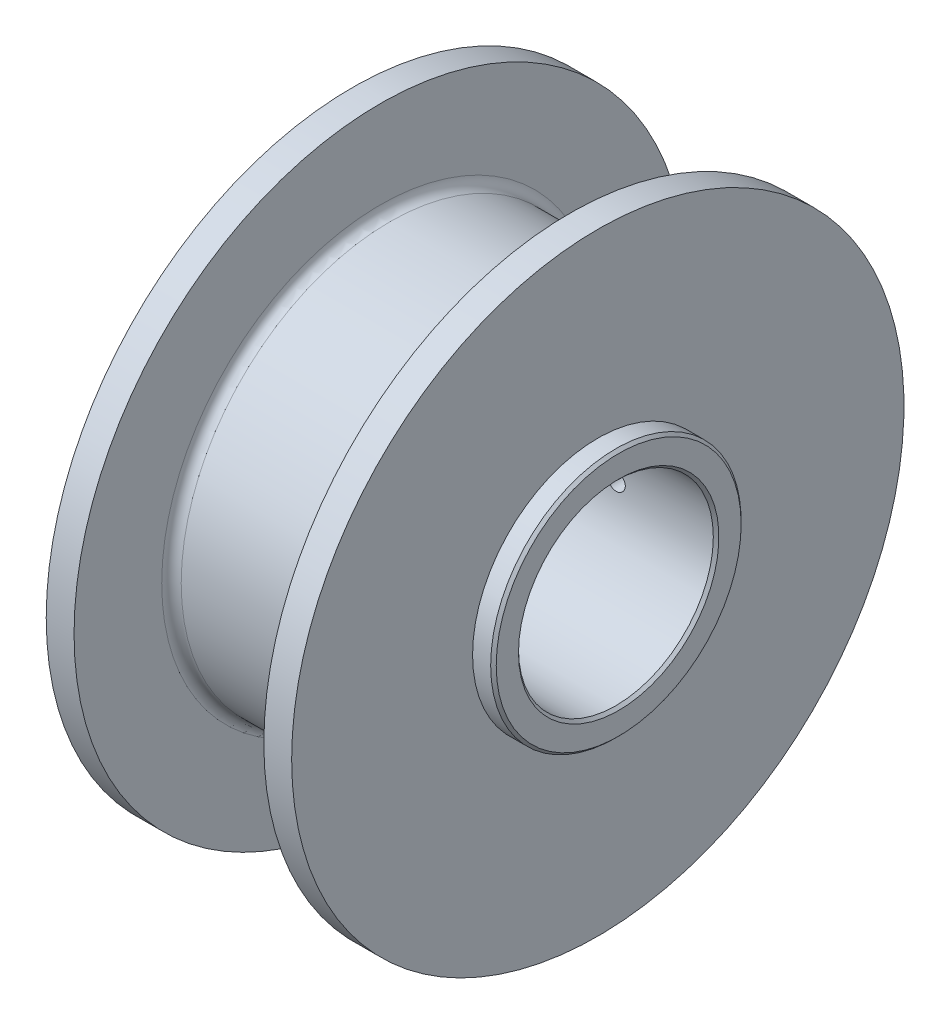
ISO-10303-21;
HEADER;
FILE_DESCRIPTION(('STEP AP214'),'2;1');
FILE_NAME('part.step','',(''),(''),'','','');
FILE_SCHEMA(('AUTOMOTIVE_DESIGN { 1 0 10303 214 1 1 1 1 }'));
ENDSEC;
DATA;
#1=APPLICATION_CONTEXT('core data for automotive mechanical design processes');
#2=APPLICATION_PROTOCOL_DEFINITION('international standard','automotive_design',2000,#1);
#3=PRODUCT_CONTEXT('',#1,'mechanical');
#4=PRODUCT('Part','Part','',(#3));
#5=PRODUCT_RELATED_PRODUCT_CATEGORY('part','',(#4));
#6=PRODUCT_DEFINITION_FORMATION('','',#4);
#7=PRODUCT_DEFINITION_CONTEXT('part definition',#1,'design');
#8=PRODUCT_DEFINITION('design','',#6,#7);
#9=PRODUCT_DEFINITION_SHAPE('','',#8);
#10=(LENGTH_UNIT() NAMED_UNIT(*) SI_UNIT(.MILLI.,.METRE.));
#11=(NAMED_UNIT(*) PLANE_ANGLE_UNIT() SI_UNIT($,.RADIAN.));
#12=(NAMED_UNIT(*) SI_UNIT($,.STERADIAN.) SOLID_ANGLE_UNIT());
#13=UNCERTAINTY_MEASURE_WITH_UNIT(LENGTH_MEASURE(1.E-05),#10,'distance_accuracy_value','');
#14=(GEOMETRIC_REPRESENTATION_CONTEXT(3) GLOBAL_UNCERTAINTY_ASSIGNED_CONTEXT((#13)) GLOBAL_UNIT_ASSIGNED_CONTEXT((#10,
#11,#12)) REPRESENTATION_CONTEXT('',''));
#15=CARTESIAN_POINT('',(0.,0.,0.));
#16=DIRECTION('',(0.,0.,1.));
#17=DIRECTION('',(1.,0.,0.));
#18=AXIS2_PLACEMENT_3D('',#15,#16,#17);
#19=CARTESIAN_POINT('',(0.,0.,0.));
#20=DIRECTION('',(-1.,0.,0.));
#21=DIRECTION('',(0.,0.,1.));
#22=AXIS2_PLACEMENT_3D('',#19,#20,#21);
#23=CYLINDRICAL_SURFACE('',#22,38.1);
#24=CARTESIAN_POINT('',(10.668,0.,0.));
#25=DIRECTION('',(-1.,0.,0.));
#26=DIRECTION('',(0.,0.,1.));
#27=AXIS2_PLACEMENT_3D('',#24,#25,#26);
#28=CIRCLE('',#27,38.1);
#29=CARTESIAN_POINT('',(10.668,0.,38.1));
#30=VERTEX_POINT('',#29);
#31=EDGE_CURVE('E193',#30,#30,#28,.F.);
#32=ORIENTED_EDGE('',*,*,#31,.T.);
#33=EDGE_LOOP('',(#32));
#34=FACE_BOUND('',#33,.T.);
#35=DIRECTION('',(-1.,0.,0.));
#36=VECTOR('',#35,1.);
#37=CARTESIAN_POINT('',(0.,-13.6783186101216,-35.56));
#38=LINE('',#37,#36);
#39=CARTESIAN_POINT('',(41.7500054,-13.6783186101216,-35.56));
#40=VERTEX_POINT('',#39);
#41=CARTESIAN_POINT('',(24.0970054,-13.6783186101216,-35.56));
#42=VERTEX_POINT('',#41);
#43=EDGE_CURVE('E142',#40,#42,#38,.T.);
#44=ORIENTED_EDGE('',*,*,#43,.F.);
#45=CARTESIAN_POINT('',(41.7500054,0.,0.));
#46=DIRECTION('',(1.,0.,0.));
#47=DIRECTION('',(0.,0.,-1.));
#48=AXIS2_PLACEMENT_3D('',#45,#46,#47);
#49=CIRCLE('',#48,38.1);
#50=CARTESIAN_POINT('',(41.7500054,13.6783186101216,-35.56));
#51=VERTEX_POINT('',#50);
#52=EDGE_CURVE('E190',#40,#51,#49,.F.);
#53=ORIENTED_EDGE('',*,*,#52,.T.);
#54=DIRECTION('',(-1.,0.,0.));
#55=VECTOR('',#54,1.);
#56=CARTESIAN_POINT('',(0.,13.6783186101216,-35.56));
#57=LINE('',#56,#55);
#58=CARTESIAN_POINT('',(24.0970054,13.6783186101216,-35.56));
#59=VERTEX_POINT('',#58);
#60=EDGE_CURVE('E139',#59,#51,#57,.F.);
#61=ORIENTED_EDGE('',*,*,#60,.F.);
#62=CARTESIAN_POINT('',(24.0970054,0.,0.));
#63=DIRECTION('',(-1.,0.,0.));
#64=DIRECTION('',(0.,-1.,0.));
#65=AXIS2_PLACEMENT_3D('',#62,#63,#64);
#66=CIRCLE('',#65,38.1);
#67=EDGE_CURVE('E184',#59,#42,#66,.T.);
#68=ORIENTED_EDGE('',*,*,#67,.T.);
#69=EDGE_LOOP('',(#44,#53,#61,#68));
#70=FACE_BOUND('',#69,.T.);
#71=ADVANCED_FACE('F41',(#34,#70),#23,.T.);
#72=CARTESIAN_POINT('',(43.5280054,38.1,0.));
#73=DIRECTION('',(1.,0.,0.));
#74=DIRECTION('',(0.,0.,-1.));
#75=AXIS2_PLACEMENT_3D('',#72,#73,#74);
#76=PLANE('',#75);
#77=CARTESIAN_POINT('',(43.5280054,0.,0.));
#78=DIRECTION('',(-1.,0.,0.));
#79=DIRECTION('',(0.,0.,1.));
#80=AXIS2_PLACEMENT_3D('',#77,#78,#79);
#81=CIRCLE('',#80,55.88);
#82=CARTESIAN_POINT('',(43.5280054,0.,55.88));
#83=VERTEX_POINT('',#82);
#84=EDGE_CURVE('E165',#83,#83,#81,.T.);
#85=ORIENTED_EDGE('',*,*,#84,.T.);
#86=EDGE_LOOP('',(#85));
#87=FACE_BOUND('',#86,.T.);
#88=DIRECTION('',(0.,1.,0.));
#89=VECTOR('',#88,1.);
#90=CARTESIAN_POINT('',(43.5280054,38.1,-35.56));
#91=LINE('',#90,#89);
#92=CARTESIAN_POINT('',(43.5280054,18.0483041862664,-35.56));
#93=VERTEX_POINT('',#92);
#94=CARTESIAN_POINT('',(43.5280054,25.4,-35.56));
#95=VERTEX_POINT('',#94);
#96=EDGE_CURVE('E181',#93,#95,#91,.T.);
#97=ORIENTED_EDGE('',*,*,#96,.F.);
#98=CARTESIAN_POINT('',(43.5280054,0.,0.));
#99=DIRECTION('',(1.,0.,0.));
#100=DIRECTION('',(0.,0.,-1.));
#101=AXIS2_PLACEMENT_3D('',#98,#99,#100);
#102=CIRCLE('',#101,39.878);
#103=CARTESIAN_POINT('',(43.5280054,-18.0483041862664,-35.56));
#104=VERTEX_POINT('',#103);
#105=EDGE_CURVE('E64',#93,#104,#102,.T.);
#106=ORIENTED_EDGE('',*,*,#105,.T.);
#107=CARTESIAN_POINT('',(43.5280054,-25.4,-35.56));
#108=VERTEX_POINT('',#107);
#109=EDGE_CURVE('E183',#108,#104,#91,.T.);
#110=ORIENTED_EDGE('',*,*,#109,.F.);
#111=DIRECTION('',(0.,0.,-1.));
#112=VECTOR('',#111,1.);
#113=CARTESIAN_POINT('',(43.5280054,-25.4,0.));
#114=LINE('',#113,#112);
#115=CARTESIAN_POINT('',(43.5280054,-25.4,-38.1));
#116=VERTEX_POINT('',#115);
#117=EDGE_CURVE('E120',#108,#116,#114,.T.);
#118=ORIENTED_EDGE('',*,*,#117,.T.);
#119=DIRECTION('',(0.,1.,0.));
#120=VECTOR('',#119,1.);
#121=CARTESIAN_POINT('',(43.5280054,38.1,-38.1));
#122=LINE('',#121,#120);
#123=CARTESIAN_POINT('',(43.5280054,25.4,-38.1));
#124=VERTEX_POINT('',#123);
#125=EDGE_CURVE('E174',#116,#124,#122,.T.);
#126=ORIENTED_EDGE('',*,*,#125,.T.);
#127=DIRECTION('',(0.,0.,1.));
#128=VECTOR('',#127,1.);
#129=CARTESIAN_POINT('',(43.5280054,25.4,0.));
#130=LINE('',#129,#128);
#131=EDGE_CURVE('E178',#124,#95,#130,.T.);
#132=ORIENTED_EDGE('',*,*,#131,.T.);
#133=EDGE_LOOP('',(#97,#106,#110,#118,#126,#132));
#134=FACE_BOUND('',#133,.T.);
#135=ADVANCED_FACE('F284',(#87,#134),#76,.F.);
#136=CARTESIAN_POINT('',(3.81,22.86,0.));
#137=DIRECTION('',(1.,0.,0.));
#138=DIRECTION('',(0.,0.,-1.));
#139=AXIS2_PLACEMENT_3D('',#136,#137,#138);
#140=PLANE('',#139);
#141=CARTESIAN_POINT('',(3.81,0.,0.));
#142=DIRECTION('',(-1.,0.,0.));
#143=DIRECTION('',(0.,0.,1.));
#144=AXIS2_PLACEMENT_3D('',#141,#142,#143);
#145=CIRCLE('',#144,22.86);
#146=CARTESIAN_POINT('',(3.81,0.,22.86));
#147=VERTEX_POINT('',#146);
#148=EDGE_CURVE('E144',#147,#147,#145,.T.);
#149=ORIENTED_EDGE('',*,*,#148,.F.);
#150=EDGE_LOOP('',(#149));
#151=FACE_BOUND('',#150,.T.);
#152=CARTESIAN_POINT('',(3.81,0.,0.));
#153=DIRECTION('',(-1.,0.,0.));
#154=DIRECTION('',(0.,0.,1.));
#155=AXIS2_PLACEMENT_3D('',#152,#153,#154);
#156=CIRCLE('',#155,55.88);
#157=CARTESIAN_POINT('',(3.81,0.,55.88));
#158=VERTEX_POINT('',#157);
#159=EDGE_CURVE('E171',#158,#158,#156,.T.);
#160=ORIENTED_EDGE('',*,*,#159,.T.);
#161=EDGE_LOOP('',(#160));
#162=FACE_BOUND('',#161,.T.);
#163=ADVANCED_FACE('F287',(#151,#162),#140,.F.);
#164=CARTESIAN_POINT('',(0.,0.,0.));
#165=DIRECTION('',(-1.,0.,0.));
#166=DIRECTION('',(0.,0.,1.));
#167=AXIS2_PLACEMENT_3D('',#164,#165,#166);
#168=CYLINDRICAL_SURFACE('',#167,55.88);
#169=ORIENTED_EDGE('',*,*,#159,.F.);
#170=EDGE_LOOP('',(#169));
#171=FACE_BOUND('',#170,.T.);
#172=CARTESIAN_POINT('',(8.89,0.,0.));
#173=DIRECTION('',(-1.,0.,0.));
#174=DIRECTION('',(0.,0.,1.));
#175=AXIS2_PLACEMENT_3D('',#172,#173,#174);
#176=CIRCLE('',#175,55.88);
#177=CARTESIAN_POINT('',(8.89,0.,55.88));
#178=VERTEX_POINT('',#177);
#179=EDGE_CURVE('E168',#178,#178,#176,.T.);
#180=ORIENTED_EDGE('',*,*,#179,.T.);
#181=EDGE_LOOP('',(#180));
#182=FACE_BOUND('',#181,.T.);
#183=ADVANCED_FACE('F294',(#171,#182),#168,.T.);
#184=CARTESIAN_POINT('',(8.89,55.88,0.));
#185=DIRECTION('',(-1.,0.,0.));
#186=DIRECTION('',(0.,0.,1.));
#187=AXIS2_PLACEMENT_3D('',#184,#185,#186);
#188=PLANE('',#187);
#189=CARTESIAN_POINT('',(8.89,0.,0.));
#190=DIRECTION('',(-1.,0.,0.));
#191=DIRECTION('',(0.,0.,1.));
#192=AXIS2_PLACEMENT_3D('',#189,#190,#191);
#193=CIRCLE('',#192,39.878);
#194=CARTESIAN_POINT('',(8.89,0.,39.878));
#195=VERTEX_POINT('',#194);
#196=EDGE_CURVE('E187',#195,#195,#193,.T.);
#197=ORIENTED_EDGE('',*,*,#196,.T.);
#198=EDGE_LOOP('',(#197));
#199=FACE_BOUND('',#198,.T.);
#200=ORIENTED_EDGE('',*,*,#179,.F.);
#201=EDGE_LOOP('',(#200));
#202=FACE_BOUND('',#201,.T.);
#203=ADVANCED_FACE('F282',(#199,#202),#188,.F.);
#204=CARTESIAN_POINT('',(0.,0.,0.));
#205=DIRECTION('',(-1.,0.,0.));
#206=DIRECTION('',(0.,0.,1.));
#207=AXIS2_PLACEMENT_3D('',#204,#205,#206);
#208=CYLINDRICAL_SURFACE('',#207,55.88);
#209=ORIENTED_EDGE('',*,*,#84,.F.);
#210=EDGE_LOOP('',(#209));
#211=FACE_BOUND('',#210,.T.);
#212=CARTESIAN_POINT('',(48.6080054,0.,0.));
#213=DIRECTION('',(-1.,0.,0.));
#214=DIRECTION('',(0.,0.,1.));
#215=AXIS2_PLACEMENT_3D('',#212,#213,#214);
#216=CIRCLE('',#215,55.88);
#217=CARTESIAN_POINT('',(48.6080054,0.,55.88));
#218=VERTEX_POINT('',#217);
#219=EDGE_CURVE('E162',#218,#218,#216,.T.);
#220=ORIENTED_EDGE('',*,*,#219,.T.);
#221=EDGE_LOOP('',(#220));
#222=FACE_BOUND('',#221,.T.);
#223=ADVANCED_FACE('F278',(#211,#222),#208,.T.);
#224=CARTESIAN_POINT('',(48.6080054,55.88,0.));
#225=DIRECTION('',(-1.,0.,0.));
#226=DIRECTION('',(0.,0.,1.));
#227=AXIS2_PLACEMENT_3D('',#224,#225,#226);
#228=PLANE('',#227);
#229=ORIENTED_EDGE('',*,*,#219,.F.);
#230=EDGE_LOOP('',(#229));
#231=FACE_BOUND('',#230,.T.);
#232=CARTESIAN_POINT('',(48.6080054,0.,0.));
#233=DIRECTION('',(-1.,0.,0.));
#234=DIRECTION('',(0.,0.,1.));
#235=AXIS2_PLACEMENT_3D('',#232,#233,#234);
#236=CIRCLE('',#235,22.86);
#237=CARTESIAN_POINT('',(48.6080054,0.,22.86));
#238=VERTEX_POINT('',#237);
#239=EDGE_CURVE('E159',#238,#238,#236,.T.);
#240=ORIENTED_EDGE('',*,*,#239,.T.);
#241=EDGE_LOOP('',(#240));
#242=FACE_BOUND('',#241,.T.);
#243=ADVANCED_FACE('F274',(#231,#242),#228,.F.);
#244=CARTESIAN_POINT('',(0.,0.,0.));
#245=DIRECTION('',(-1.,0.,0.));
#246=DIRECTION('',(0.,0.,1.));
#247=AXIS2_PLACEMENT_3D('',#244,#245,#246);
#248=CYLINDRICAL_SURFACE('',#247,22.86);
#249=CARTESIAN_POINT('',(51.9100053999999,0.,0.));
#250=DIRECTION('',(-1.,0.,0.));
#251=DIRECTION('',(0.,0.,1.));
#252=AXIS2_PLACEMENT_3D('',#249,#250,#251);
#253=CIRCLE('',#252,22.86);
#254=CARTESIAN_POINT('',(51.9100053999999,0.,22.86));
#255=VERTEX_POINT('',#254);
#256=EDGE_CURVE('E336',#255,#255,#253,.T.);
#257=ORIENTED_EDGE('',*,*,#256,.T.);
#258=EDGE_LOOP('',(#257));
#259=FACE_BOUND('',#258,.T.);
#260=ORIENTED_EDGE('',*,*,#239,.F.);
#261=EDGE_LOOP('',(#260));
#262=FACE_BOUND('',#261,.T.);
#263=ADVANCED_FACE('F270',(#259,#262),#248,.T.);
#264=CARTESIAN_POINT('',(52.4180054,22.86,0.));
#265=DIRECTION('',(-1.,0.,0.));
#266=DIRECTION('',(0.,0.,1.));
#267=AXIS2_PLACEMENT_3D('',#264,#265,#266);
#268=PLANE('',#267);
#269=CARTESIAN_POINT('',(52.4180054,0.,0.));
#270=DIRECTION('',(-1.,0.,0.));
#271=DIRECTION('',(0.,0.,1.));
#272=AXIS2_PLACEMENT_3D('',#269,#270,#271);
#273=CIRCLE('',#272,22.352);
#274=CARTESIAN_POINT('',(52.4180054,0.,22.352));
#275=VERTEX_POINT('',#274);
#276=EDGE_CURVE('E50',#275,#275,#273,.F.);
#277=ORIENTED_EDGE('',*,*,#276,.T.);
#278=EDGE_LOOP('',(#277));
#279=FACE_BOUND('',#278,.T.);
#280=CARTESIAN_POINT('',(52.4180054,0.,0.));
#281=DIRECTION('',(-1.,0.,0.));
#282=DIRECTION('',(0.,0.,1.));
#283=AXIS2_PLACEMENT_3D('',#280,#281,#282);
#284=CIRCLE('',#283,18.288);
#285=CARTESIAN_POINT('',(52.4180054,0.,18.288));
#286=VERTEX_POINT('',#285);
#287=EDGE_CURVE('E339',#286,#286,#284,.T.);
#288=ORIENTED_EDGE('',*,*,#287,.T.);
#289=EDGE_LOOP('',(#288));
#290=FACE_BOUND('',#289,.T.);
#291=ADVANCED_FACE('F266',(#279,#290),#268,.F.);
#292=CARTESIAN_POINT('',(0.,0.,0.));
#293=DIRECTION('',(-1.,0.,0.));
#294=DIRECTION('',(0.,0.,1.));
#295=AXIS2_PLACEMENT_3D('',#292,#293,#294);
#296=CYLINDRICAL_SURFACE('',#295,17.78);
#297=CARTESIAN_POINT('',(51.9100054,0.,0.));
#298=DIRECTION('',(-1.,0.,0.));
#299=DIRECTION('',(0.,0.,1.));
#300=AXIS2_PLACEMENT_3D('',#297,#298,#299);
#301=CIRCLE('',#300,17.78);
#302=CARTESIAN_POINT('',(51.9100054,0.,17.78));
#303=VERTEX_POINT('',#302);
#304=EDGE_CURVE('E11',#303,#303,#301,.F.);
#305=ORIENTED_EDGE('',*,*,#304,.T.);
#306=EDGE_LOOP('',(#305));
#307=FACE_BOUND('',#306,.T.);
#308=CARTESIAN_POINT('',(32.6695054,0.,-17.78));
#309=CARTESIAN_POINT('',(32.6695092757615,0.08898048332588,-17.7799990763093));
#310=CARTESIAN_POINT('',(32.6770116995419,0.178020954503884,-17.7793249292199));
#311=CARTESIAN_POINT('',(32.7068289424718,0.353636652087076,-17.776700442567));
#312=CARTESIAN_POINT('',(32.7291603875949,0.440208997530001,-17.7747486705936));
#313=CARTESIAN_POINT('',(32.7879832806623,0.608319686388856,-17.7697894133356));
#314=CARTESIAN_POINT('',(32.8244665344485,0.689860911306233,-17.7667825390706));
#315=CARTESIAN_POINT('',(32.9105423293611,0.845643318045957,-17.7600499507272));
#316=CARTESIAN_POINT('',(32.9601321329061,0.919886019882227,-17.7563243868063));
#317=CARTESIAN_POINT('',(33.0711684038296,1.05919831353758,-17.7485601402178));
#318=CARTESIAN_POINT('',(33.1326450878613,1.124243780334,-17.7445206756034));
#319=CARTESIAN_POINT('',(33.265645929362,1.24310807370043,-17.736590428881));
#320=CARTESIAN_POINT('',(33.3371705356534,1.29692639850732,-17.7326996534244));
#321=CARTESIAN_POINT('',(33.4883848423961,1.39189180089069,-17.7254990702298));
#322=CARTESIAN_POINT('',(33.5680880582058,1.43301743908367,-17.7221902494893));
#323=CARTESIAN_POINT('',(33.7333030760566,1.5012931351879,-17.7165374571206));
#324=CARTESIAN_POINT('',(33.8188147617629,1.52844347290963,-17.714193466175));
#325=CARTESIAN_POINT('',(33.9929759487738,1.5679273065113,-17.7107424967424));
#326=CARTESIAN_POINT('',(34.0816164103926,1.58030038244717,-17.7096322143956));
#327=CARTESIAN_POINT('',(34.2597223709349,1.59000076633673,-17.7087640034012));
#328=CARTESIAN_POINT('',(34.3491878522519,1.58732839463483,-17.7090060459602));
#329=CARTESIAN_POINT('',(34.5261324796895,1.56704642241123,-17.7108121287498));
#330=CARTESIAN_POINT('',(34.6136166084401,1.54947990441889,-17.7123723559779));
#331=CARTESIAN_POINT('',(34.7843897929156,1.49997525622691,-17.7166330383995));
#332=CARTESIAN_POINT('',(34.8676788023532,1.46803696749329,-17.7193335061708));
#333=CARTESIAN_POINT('',(35.0278343723997,1.39064738114084,-17.7255747850959));
#334=CARTESIAN_POINT('',(35.1046915793209,1.3451768267048,-17.729116792327));
#335=CARTESIAN_POINT('',(35.2496995392052,1.24202731738588,-17.7366409850484));
#336=CARTESIAN_POINT('',(35.3178500893412,1.18434807817729,-17.7406231807892));
#337=CARTESIAN_POINT('',(35.4437606431952,1.05817720352496,-17.7485960321358));
#338=CARTESIAN_POINT('',(35.5014833451894,0.989648335530303,-17.7525866683903));
#339=CARTESIAN_POINT('',(35.6046110201571,0.843853175311964,-17.7601134854051));
#340=CARTESIAN_POINT('',(35.6500159832073,0.766586876049362,-17.7636496657993));
#341=CARTESIAN_POINT('',(35.7272172558882,0.605485375810631,-17.7698699703674));
#342=CARTESIAN_POINT('',(35.7590118325367,0.521649339930411,-17.7725539860257));
#343=CARTESIAN_POINT('',(35.8080632744653,0.349799647292248,-17.7767663543679));
#344=CARTESIAN_POINT('',(35.825320486151,0.261786090131772,-17.7782947345891));
#345=CARTESIAN_POINT('',(35.8447603752215,0.0844029634158367,-17.7800200911068));
#346=CARTESIAN_POINT('',(35.8469945591619,-0.00496091903111652,-17.7802216164848));
#347=CARTESIAN_POINT('',(35.8364600198978,-0.182791927506068,-17.7792827229832));
#348=CARTESIAN_POINT('',(35.8236914576784,-0.271259063146216,-17.7781423185028));
#349=CARTESIAN_POINT('',(35.7835565828736,-0.44463785257497,-17.7746507027356));
#350=CARTESIAN_POINT('',(35.7562142259988,-0.529555095187436,-17.7723014786675));
#351=CARTESIAN_POINT('',(35.6877324292993,-0.693596932915325,-17.7666560062967));
#352=CARTESIAN_POINT('',(35.6465927402951,-0.772721423382324,-17.7633597408907));
#353=CARTESIAN_POINT('',(35.5515552199422,-0.923165590029465,-17.7561780844188));
#354=CARTESIAN_POINT('',(35.4976233610648,-0.994463694887755,-17.7522911321919));
#355=CARTESIAN_POINT('',(35.3785814595345,-1.12701324560837,-17.7443697755041));
#356=CARTESIAN_POINT('',(35.3134711938198,-1.18826449094086,-17.740335368102));
#357=CARTESIAN_POINT('',(35.1736967952414,-1.29915902956368,-17.7325602609209));
#358=CARTESIAN_POINT('',(35.0990058887697,-1.34876864638263,-17.7288204335288));
#359=CARTESIAN_POINT('',(34.942323267014,-1.43474058480238,-17.7220706183032));
#360=CARTESIAN_POINT('',(34.8603316338215,-1.4711030553344,-17.7190606222646));
#361=CARTESIAN_POINT('',(34.6914929796611,-1.52949146997304,-17.7141163800731));
#362=CARTESIAN_POINT('',(34.6046530672578,-1.55153783451061,-17.7121806022361));
#363=CARTESIAN_POINT('',(34.4284860357652,-1.58073463208906,-17.709598986164));
#364=CARTESIAN_POINT('',(34.3391589723697,-1.58788539841084,-17.7089531190677));
#365=CARTESIAN_POINT('',(34.16088798812,-1.58708390972292,-17.7090249414536));
#366=CARTESIAN_POINT('',(34.0719438227044,-1.57918456282987,-17.7097378541987));
#367=CARTESIAN_POINT('',(33.8966510210813,-1.54861761037535,-17.712436748401));
#368=CARTESIAN_POINT('',(33.8103023885153,-1.52594998409525,-17.7144227316443));
#369=CARTESIAN_POINT('',(33.6426496527444,-1.46650374328403,-17.719442717817));
#370=CARTESIAN_POINT('',(33.5613451346679,-1.42972629105935,-17.7224766344203));
#371=CARTESIAN_POINT('',(33.4060553994004,-1.34311010608194,-17.7292508034269));
#372=CARTESIAN_POINT('',(33.3320700923313,-1.29327153374393,-17.7329910471552));
#373=CARTESIAN_POINT('',(33.1932479607548,-1.18174892065715,-17.7407721268664));
#374=CARTESIAN_POINT('',(33.1284427547524,-1.12002558888324,-17.7448139318797));
#375=CARTESIAN_POINT('',(33.0100841324963,-0.986559605256345,-17.7527338540641));
#376=CARTESIAN_POINT('',(32.9565334330367,-0.914814541137829,-17.756611931532));
#377=CARTESIAN_POINT('',(32.8621208441185,-0.763183749127804,-17.7637754783165));
#378=CARTESIAN_POINT('',(32.8212855661334,-0.68328140690875,-17.7670596988399));
#379=CARTESIAN_POINT('',(32.7536640297225,-0.517778237038183,-17.772651270696));
#380=CARTESIAN_POINT('',(32.7268617257954,-0.432184044347385,-17.7749597371348));
#381=CARTESIAN_POINT('',(32.6948450835604,-0.288409688760095,-17.7777512972455));
#382=CARTESIAN_POINT('',(32.6853554504072,-0.231152368514078,-17.7785906906135));
#383=CARTESIAN_POINT('',(32.6726843557167,-0.115938521330189,-17.7797153420748));
#384=CARTESIAN_POINT('',(32.669502874453,-0.0579819965793835,-17.7800006019009));
#385=CARTESIAN_POINT('',(32.6695054,0.,-17.78));
#386=B_SPLINE_CURVE_WITH_KNOTS('',3,(#308,#309,#310,#311,#312,#313,#314,#315,#316,#317,#318,
#319,#320,#321,#322,#323,#324,#325,#326,#327,#328,#329,#330,#331,#332,#333,#334,#335,#336,#337,
#338,#339,#340,#341,#342,#343,#344,#345,#346,#347,#348,#349,#350,#351,#352,#353,#354,#355,#356,
#357,#358,#359,#360,#361,#362,#363,#364,#365,#366,#367,#368,#369,#370,#371,#372,#373,#374,#375,
#376,#377,#378,#379,#380,#381,#382,#383,#384,#385),.UNSPECIFIED.,.T.,.F.,(4,2,2,2,2,2,2,2,2,2,2,
2,2,2,2,2,2,2,2,2,2,2,2,2,2,2,2,2,2,2,2,2,2,2,2,2,2,2,4),(0.,0.266729742042972,
0.533759041688208,0.800633956686524,1.0674531731817,1.33495978392314,1.60247834750211,
1.87044633792405,2.13840896293957,2.40565224404156,2.67288983507898,2.9393570465056,
3.20582719738499,3.47267837129817,3.7395357605408,4.00732960522498,4.27512366564691,
4.54295181359593,4.81077357938244,5.07767664609388,5.34457684886295,5.61103968064445,
5.87750732499814,6.14469189094718,6.4118817891058,6.67983533016435,6.94778585865873,
7.21535333922029,7.48291483304105,7.74953745957444,8.01616046015732,8.28276150220451,
8.54935927005113,8.81685403185168,9.08441329187101,9.35252880714902,9.62033708213216,
9.79414566099632,9.96795369633947),.UNSPECIFIED.);
#387=CARTESIAN_POINT('',(32.6695054,0.,-17.78));
#388=VERTEX_POINT('',#387);
#389=EDGE_CURVE('E560',#388,#388,#386,.T.);
#390=ORIENTED_EDGE('',*,*,#389,.T.);
#391=EDGE_LOOP('',(#390));
#392=FACE_BOUND('',#391,.T.);
#393=CARTESIAN_POINT('',(15.0800054,0.,0.));
#394=DIRECTION('',(-1.,0.,0.));
#395=DIRECTION('',(0.,0.,1.));
#396=AXIS2_PLACEMENT_3D('',#393,#394,#395);
#397=CIRCLE('',#396,17.78);
#398=CARTESIAN_POINT('',(15.0800054,0.,17.78));
#399=VERTEX_POINT('',#398);
#400=EDGE_CURVE('E156',#399,#399,#397,.T.);
#401=ORIENTED_EDGE('',*,*,#400,.T.);
#402=EDGE_LOOP('',(#401));
#403=FACE_BOUND('',#402,.T.);
#404=ADVANCED_FACE('F262',(#307,#392,#403),#296,.F.);
#405=CARTESIAN_POINT('',(15.0800054,17.78,0.));
#406=DIRECTION('',(-1.,0.,0.));
#407=DIRECTION('',(0.,0.,1.));
#408=AXIS2_PLACEMENT_3D('',#405,#406,#407);
#409=PLANE('',#408);
#410=ORIENTED_EDGE('',*,*,#400,.F.);
#411=EDGE_LOOP('',(#410));
#412=FACE_BOUND('',#411,.T.);
#413=CARTESIAN_POINT('',(15.0800054,0.,0.));
#414=DIRECTION('',(-1.,0.,0.));
#415=DIRECTION('',(0.,0.,1.));
#416=AXIS2_PLACEMENT_3D('',#413,#414,#415);
#417=CIRCLE('',#416,16.002);
#418=CARTESIAN_POINT('',(15.0800054,0.,16.002));
#419=VERTEX_POINT('',#418);
#420=EDGE_CURVE('E153',#419,#419,#417,.T.);
#421=ORIENTED_EDGE('',*,*,#420,.T.);
#422=EDGE_LOOP('',(#421));
#423=FACE_BOUND('',#422,.T.);
#424=ADVANCED_FACE('F258',(#412,#423),#409,.F.);
#425=CARTESIAN_POINT('',(0.,0.,0.));
#426=DIRECTION('',(-1.,0.,0.));
#427=DIRECTION('',(0.,0.,1.));
#428=AXIS2_PLACEMENT_3D('',#425,#426,#427);
#429=CYLINDRICAL_SURFACE('',#428,16.002);
#430=ORIENTED_EDGE('',*,*,#420,.F.);
#431=EDGE_LOOP('',(#430));
#432=FACE_BOUND('',#431,.T.);
#433=CARTESIAN_POINT('',(5.08,0.,0.));
#434=DIRECTION('',(-1.,0.,0.));
#435=DIRECTION('',(0.,0.,1.));
#436=AXIS2_PLACEMENT_3D('',#433,#434,#435);
#437=CIRCLE('',#436,16.002);
#438=CARTESIAN_POINT('',(5.08,0.,16.002));
#439=VERTEX_POINT('',#438);
#440=EDGE_CURVE('E150',#439,#439,#437,.T.);
#441=ORIENTED_EDGE('',*,*,#440,.T.);
#442=EDGE_LOOP('',(#441));
#443=FACE_BOUND('',#442,.T.);
#444=ADVANCED_FACE('F254',(#432,#443),#429,.F.);
#445=CARTESIAN_POINT('',(5.08,16.002,0.));
#446=DIRECTION('',(-1.,0.,0.));
#447=DIRECTION('',(0.,0.,1.));
#448=AXIS2_PLACEMENT_3D('',#445,#446,#447);
#449=PLANE('',#448);
#450=ORIENTED_EDGE('',*,*,#440,.F.);
#451=EDGE_LOOP('',(#450));
#452=FACE_BOUND('',#451,.T.);
#453=CARTESIAN_POINT('',(5.08,0.,0.));
#454=DIRECTION('',(-1.,0.,0.));
#455=DIRECTION('',(0.,0.,1.));
#456=AXIS2_PLACEMENT_3D('',#453,#454,#455);
#457=CIRCLE('',#456,11.079988);
#458=CARTESIAN_POINT('',(5.08,0.,11.079988));
#459=VERTEX_POINT('',#458);
#460=EDGE_CURVE('E147',#459,#459,#457,.T.);
#461=ORIENTED_EDGE('',*,*,#460,.T.);
#462=EDGE_LOOP('',(#461));
#463=FACE_BOUND('',#462,.T.);
#464=ADVANCED_FACE('F250',(#452,#463),#449,.F.);
#465=CARTESIAN_POINT('',(0.,0.,0.));
#466=DIRECTION('',(-1.,0.,0.));
#467=DIRECTION('',(0.,0.,1.));
#468=AXIS2_PLACEMENT_3D('',#465,#466,#467);
#469=CYLINDRICAL_SURFACE('',#468,11.079988);
#470=CARTESIAN_POINT('',(0.507999999999977,0.,0.));
#471=DIRECTION('',(1.,0.,0.));
#472=DIRECTION('',(0.,0.,-1.));
#473=AXIS2_PLACEMENT_3D('',#470,#471,#472);
#474=CIRCLE('',#473,11.079988);
#475=CARTESIAN_POINT('',(0.507999999999977,0.,-11.079988));
#476=VERTEX_POINT('',#475);
#477=EDGE_CURVE('E323',#476,#476,#474,.F.);
#478=ORIENTED_EDGE('',*,*,#477,.T.);
#479=EDGE_LOOP('',(#478));
#480=FACE_BOUND('',#479,.T.);
#481=ORIENTED_EDGE('',*,*,#460,.F.);
#482=EDGE_LOOP('',(#481));
#483=FACE_BOUND('',#482,.T.);
#484=ADVANCED_FACE('F246',(#480,#483),#469,.F.);
#485=CARTESIAN_POINT('',(0.,11.079988,0.));
#486=DIRECTION('',(1.,0.,0.));
#487=DIRECTION('',(0.,0.,-1.));
#488=AXIS2_PLACEMENT_3D('',#485,#486,#487);
#489=PLANE('',#488);
#490=CARTESIAN_POINT('',(0.,0.,0.));
#491=DIRECTION('',(1.,0.,0.));
#492=DIRECTION('',(0.,0.,-1.));
#493=AXIS2_PLACEMENT_3D('',#490,#491,#492);
#494=CIRCLE('',#493,11.587988);
#495=CARTESIAN_POINT('',(0.,0.,-11.587988));
#496=VERTEX_POINT('',#495);
#497=EDGE_CURVE('E328',#496,#496,#494,.T.);
#498=ORIENTED_EDGE('',*,*,#497,.T.);
#499=EDGE_LOOP('',(#498));
#500=FACE_BOUND('',#499,.T.);
#501=CARTESIAN_POINT('',(0.,0.,0.));
#502=DIRECTION('',(1.,0.,0.));
#503=DIRECTION('',(0.,0.,-1.));
#504=AXIS2_PLACEMENT_3D('',#501,#502,#503);
#505=CIRCLE('',#504,22.352);
#506=CARTESIAN_POINT('',(0.,0.,-22.352));
#507=VERTEX_POINT('',#506);
#508=EDGE_CURVE('E325',#507,#507,#505,.F.);
#509=ORIENTED_EDGE('',*,*,#508,.T.);
#510=EDGE_LOOP('',(#509));
#511=FACE_BOUND('',#510,.T.);
#512=ADVANCED_FACE('F242',(#500,#511),#489,.F.);
#513=CARTESIAN_POINT('',(0.,0.,0.));
#514=DIRECTION('',(-1.,0.,0.));
#515=DIRECTION('',(0.,0.,1.));
#516=AXIS2_PLACEMENT_3D('',#513,#514,#515);
#517=CYLINDRICAL_SURFACE('',#516,22.86);
#518=CARTESIAN_POINT('',(0.507999999999967,0.,0.));
#519=DIRECTION('',(1.,0.,0.));
#520=DIRECTION('',(0.,0.,-1.));
#521=AXIS2_PLACEMENT_3D('',#518,#519,#520);
#522=CIRCLE('',#521,22.86);
#523=CARTESIAN_POINT('',(0.507999999999967,0.,-22.86));
#524=VERTEX_POINT('',#523);
#525=EDGE_CURVE('E333',#524,#524,#522,.T.);
#526=ORIENTED_EDGE('',*,*,#525,.T.);
#527=EDGE_LOOP('',(#526));
#528=FACE_BOUND('',#527,.T.);
#529=ORIENTED_EDGE('',*,*,#148,.T.);
#530=EDGE_LOOP('',(#529));
#531=FACE_BOUND('',#530,.T.);
#532=ADVANCED_FACE('F233',(#528,#531),#517,.T.);
#533=CARTESIAN_POINT('',(24.0970054,25.4,-35.56));
#534=DIRECTION('',(-1.,0.,0.));
#535=DIRECTION('',(0.,-1.,0.));
#536=AXIS2_PLACEMENT_3D('',#533,#534,#535);
#537=PLANE('',#536);
#538=DIRECTION('',(0.,1.,0.));
#539=VECTOR('',#538,1.);
#540=CARTESIAN_POINT('',(24.0970054,25.4,-35.56));
#541=LINE('',#540,#539);
#542=EDGE_CURVE('E121',#42,#59,#541,.T.);
#543=ORIENTED_EDGE('',*,*,#542,.F.);
#544=ORIENTED_EDGE('',*,*,#67,.F.);
#545=EDGE_LOOP('',(#543,#544));
#546=FACE_BOUND('',#545,.T.);
#547=ADVANCED_FACE('F229',(#546),#537,.F.);
#548=CARTESIAN_POINT('',(44.4170054,25.4,-35.56));
#549=DIRECTION('',(0.,1.,0.));
#550=DIRECTION('',(0.,0.,1.));
#551=AXIS2_PLACEMENT_3D('',#548,#549,#550);
#552=PLANE('',#551);
#553=DIRECTION('',(1.,0.,0.));
#554=VECTOR('',#553,1.);
#555=CARTESIAN_POINT('',(44.4170054,25.4,-38.1));
#556=LINE('',#555,#554);
#557=CARTESIAN_POINT('',(44.4170054,25.4,-38.1));
#558=VERTEX_POINT('',#557);
#559=EDGE_CURVE('E126',#124,#558,#556,.T.);
#560=ORIENTED_EDGE('',*,*,#559,.T.);
#561=DIRECTION('',(0.,0.,-1.));
#562=VECTOR('',#561,1.);
#563=CARTESIAN_POINT('',(44.4170054,25.4,-35.56));
#564=LINE('',#563,#562);
#565=CARTESIAN_POINT('',(44.4170054,25.4,-35.56));
#566=VERTEX_POINT('',#565);
#567=EDGE_CURVE('E113',#566,#558,#564,.T.);
#568=ORIENTED_EDGE('',*,*,#567,.F.);
#569=DIRECTION('',(1.,0.,0.));
#570=VECTOR('',#569,1.);
#571=CARTESIAN_POINT('',(44.4170054,25.4,-35.56));
#572=LINE('',#571,#570);
#573=EDGE_CURVE('E114',#95,#566,#572,.T.);
#574=ORIENTED_EDGE('',*,*,#573,.F.);
#575=ORIENTED_EDGE('',*,*,#131,.F.);
#576=EDGE_LOOP('',(#560,#568,#574,#575));
#577=FACE_BOUND('',#576,.T.);
#578=ADVANCED_FACE('F226',(#577),#552,.F.);
#579=CARTESIAN_POINT('',(44.4170054,-25.4,-35.56));
#580=DIRECTION('',(0.,-1.,0.));
#581=DIRECTION('',(0.,0.,-1.));
#582=AXIS2_PLACEMENT_3D('',#579,#580,#581);
#583=PLANE('',#582);
#584=DIRECTION('',(-1.,0.,0.));
#585=VECTOR('',#584,1.);
#586=CARTESIAN_POINT('',(44.4170054,-25.4,-35.56));
#587=LINE('',#586,#585);
#588=CARTESIAN_POINT('',(44.4170054,-25.4,-35.56));
#589=VERTEX_POINT('',#588);
#590=EDGE_CURVE('E117',#589,#108,#587,.T.);
#591=ORIENTED_EDGE('',*,*,#590,.F.);
#592=DIRECTION('',(0.,0.,-1.));
#593=VECTOR('',#592,1.);
#594=CARTESIAN_POINT('',(44.4170054,-25.4,-35.56));
#595=LINE('',#594,#593);
#596=CARTESIAN_POINT('',(44.4170054,-25.4,-38.1));
#597=VERTEX_POINT('',#596);
#598=EDGE_CURVE('E102',#589,#597,#595,.T.);
#599=ORIENTED_EDGE('',*,*,#598,.T.);
#600=DIRECTION('',(-1.,0.,0.));
#601=VECTOR('',#600,1.);
#602=CARTESIAN_POINT('',(44.4170054,-25.4,-38.1));
#603=LINE('',#602,#601);
#604=EDGE_CURVE('E128',#597,#116,#603,.T.);
#605=ORIENTED_EDGE('',*,*,#604,.T.);
#606=ORIENTED_EDGE('',*,*,#117,.F.);
#607=EDGE_LOOP('',(#591,#599,#605,#606));
#608=FACE_BOUND('',#607,.T.);
#609=ADVANCED_FACE('F118',(#608),#583,.F.);
#610=CARTESIAN_POINT('',(0.,0.,-35.56));
#611=DIRECTION('',(0.,0.,-1.));
#612=DIRECTION('',(-1.,0.,0.));
#613=AXIS2_PLACEMENT_3D('',#610,#611,#612);
#614=PLANE('',#613);
#615=CARTESIAN_POINT('',(34.2570054,0.,-35.56));
#616=DIRECTION('',(0.,0.,-1.));
#617=DIRECTION('',(-1.,0.,0.));
#618=AXIS2_PLACEMENT_3D('',#615,#616,#617);
#619=CIRCLE('',#618,1.5875);
#620=CARTESIAN_POINT('',(32.6695054,0.,-35.56));
#621=VERTEX_POINT('',#620);
#622=EDGE_CURVE('E131',#621,#621,#619,.T.);
#623=ORIENTED_EDGE('',*,*,#622,.F.);
#624=EDGE_LOOP('',(#623));
#625=FACE_BOUND('',#624,.T.);
#626=ORIENTED_EDGE('',*,*,#109,.T.);
#627=CARTESIAN_POINT('',(43.5280054,-18.0483041862664,-35.56));
#628=CARTESIAN_POINT('',(43.5279858828333,-17.9207664504077,-35.56));
#629=CARTESIAN_POINT('',(43.5251941259828,-17.7932358288549,-35.56));
#630=CARTESIAN_POINT('',(43.5142078216703,-17.5384002348821,-35.56));
#631=CARTESIAN_POINT('',(43.5060130061158,-17.4110952739732,-35.56));
#632=CARTESIAN_POINT('',(43.4843018549354,-17.1562255125604,-35.56));
#633=CARTESIAN_POINT('',(43.4707560596794,-17.0286632305676,-35.56));
#634=CARTESIAN_POINT('',(43.4383474096859,-16.7742183356306,-35.56));
#635=CARTESIAN_POINT('',(43.4194847224072,-16.6473357014088,-35.56));
#636=CARTESIAN_POINT('',(43.3765915019128,-16.3960535394895,-35.56));
#637=CARTESIAN_POINT('',(43.3526275231336,-16.2716426811622,-35.56));
#638=CARTESIAN_POINT('',(43.2991370827049,-16.0240241921,-35.56));
#639=CARTESIAN_POINT('',(43.2696110204737,-15.9008164756343,-35.56));
#640=CARTESIAN_POINT('',(43.2046065340935,-15.6562703954335,-35.56));
#641=CARTESIAN_POINT('',(43.1691416144759,-15.5349284575577,-35.56));
#642=CARTESIAN_POINT('',(43.0914860492328,-15.294439685866,-35.56));
#643=CARTESIAN_POINT('',(43.0492985200127,-15.1752918633339,-35.56));
#644=CARTESIAN_POINT('',(42.984301200352,-15.0096953773622,-35.56));
#645=CARTESIAN_POINT('',(42.964794584898,-14.9619425474644,-35.56));
#646=CARTESIAN_POINT('',(42.9243342467717,-14.8670555166417,-35.56));
#647=CARTESIAN_POINT('',(42.9033804997113,-14.8199213261585,-35.56));
#648=CARTESIAN_POINT('',(42.8378437690285,-14.6789403840968,-35.56));
#649=CARTESIAN_POINT('',(42.7908418868792,-14.5861814427253,-35.56));
#650=CARTESIAN_POINT('',(42.7065213286485,-14.4364952510812,-35.56));
#651=CARTESIAN_POINT('',(42.6714853044735,-14.3782826198157,-35.56));
#652=CARTESIAN_POINT('',(42.5972971630614,-14.2644093226636,-35.56));
#653=CARTESIAN_POINT('',(42.5581404900584,-14.2087515811517,-35.56));
#654=CARTESIAN_POINT('',(42.4752354749188,-14.1016414996128,-35.56));
#655=CARTESIAN_POINT('',(42.4315270035561,-14.0501586785496,-35.56));
#656=CARTESIAN_POINT('',(42.3382786171037,-13.952864437673,-35.56));
#657=CARTESIAN_POINT('',(42.2887562109217,-13.9070368006961,-35.56));
#658=CARTESIAN_POINT('',(42.2001082872873,-13.8377479754246,-35.56));
#659=CARTESIAN_POINT('',(42.1628885499202,-13.8118767888426,-35.56));
#660=CARTESIAN_POINT('',(42.0852939322255,-13.765697011444,-35.56));
#661=CARTESIAN_POINT('',(42.044933793355,-13.7453642344187,-35.56));
#662=CARTESIAN_POINT('',(41.9631988687905,-13.7127484271902,-35.56));
#663=CARTESIAN_POINT('',(41.9219638333687,-13.7001282898032,-35.56));
#664=CARTESIAN_POINT('',(41.8585808956328,-13.6871979234757,-35.56));
#665=CARTESIAN_POINT('',(41.8370244660786,-13.6838861046907,-35.56));
#666=CARTESIAN_POINT('',(41.7936529297643,-13.6794396328978,-35.56));
#667=CARTESIAN_POINT('',(41.7718374499968,-13.67830863831,-35.56));
#668=CARTESIAN_POINT('',(41.7500054,-13.6783186101216,-35.56));
#669=B_SPLINE_CURVE_WITH_KNOTS('',3,(#627,#628,#629,#630,#631,#632,#633,#634,#635,#636,#637,
#638,#639,#640,#641,#642,#643,#644,#645,#646,#647,#648,#649,#650,#651,#652,#653,#654,#655,#656,
#657,#658,#659,#660,#661,#662,#663,#664,#665,#666,#667,#668),.UNSPECIFIED.,.F.,.F.,(4,2,2,2,2,2,
2,2,2,2,2,2,2,2,2,2,2,2,2,2,4),(0.,0.382573131875059,0.765165247941293,1.14989374267029,
1.53461012149282,1.91458518601831,2.29453297458709,2.67362823826044,3.05254827296656,
3.20727678007204,3.36200789542492,3.67360837433594,3.87731104957128,4.08124135170128,
4.28351555842751,4.48519552202984,4.62083286048306,4.75586801245013,4.88447530504433,
4.94980287457862,5.01523993871044),.UNSPECIFIED.);
#670=EDGE_CURVE('E204',#104,#40,#669,.T.);
#671=ORIENTED_EDGE('',*,*,#670,.T.);
#672=ORIENTED_EDGE('',*,*,#43,.T.);
#673=ORIENTED_EDGE('',*,*,#542,.T.);
#674=ORIENTED_EDGE('',*,*,#60,.T.);
#675=CARTESIAN_POINT('',(41.7500054,13.6783186101216,-35.56));
#676=CARTESIAN_POINT('',(41.7705046575732,13.6783106906111,-35.56));
#677=CARTESIAN_POINT('',(41.7909910599063,13.679306833324,-35.56));
#678=CARTESIAN_POINT('',(41.8317493064744,13.6832308666185,-35.56));
#679=CARTESIAN_POINT('',(41.8520214160207,13.6861559879767,-35.56));
#680=CARTESIAN_POINT('',(41.9117619266946,13.6976076329952,-35.56));
#681=CARTESIAN_POINT('',(41.9507337103892,13.7088151006466,-35.56));
#682=CARTESIAN_POINT('',(42.0363539180735,13.740999546142,-35.56));
#683=CARTESIAN_POINT('',(42.0823070200522,13.7637762795872,-35.56));
#684=CARTESIAN_POINT('',(42.170196765139,13.816377541442,-35.56));
#685=CARTESIAN_POINT('',(42.2121087328828,13.8462419332763,-35.56));
#686=CARTESIAN_POINT('',(42.2865228117555,13.9064819723988,-35.56));
#687=CARTESIAN_POINT('',(42.3195317284534,13.9362457679194,-35.56));
#688=CARTESIAN_POINT('',(42.3828827870569,13.9985078928263,-35.56));
#689=CARTESIAN_POINT('',(42.4132227811914,14.0310083840976,-35.56));
#690=CARTESIAN_POINT('',(42.5007746804447,14.1316306001177,-35.56));
#691=CARTESIAN_POINT('',(42.5544512902872,14.2028146345216,-35.56));
#692=CARTESIAN_POINT('',(42.6727783381404,14.3768529934315,-35.56));
#693=CARTESIAN_POINT('',(42.7342841864312,14.481784221298,-35.56));
#694=CARTESIAN_POINT('',(42.847385209602,14.696973104972,-35.56));
#695=CARTESIAN_POINT('',(42.898961216273,14.8072405584689,-35.56));
#696=CARTESIAN_POINT('',(42.9945166632925,15.0319723875474,-35.56));
#697=CARTESIAN_POINT('',(43.0384349833742,15.1464624129171,-35.56));
#698=CARTESIAN_POINT('',(43.1194865817435,15.3776974556561,-35.56));
#699=CARTESIAN_POINT('',(43.1566248801843,15.494440733239,-35.56));
#700=CARTESIAN_POINT('',(43.219985327061,15.7124250616997,-35.56));
#701=CARTESIAN_POINT('',(43.2470096122306,15.8134351174249,-35.56));
#702=CARTESIAN_POINT('',(43.2970825927786,16.0164377545651,-35.56));
#703=CARTESIAN_POINT('',(43.3201308698492,16.1184304381701,-35.56));
#704=CARTESIAN_POINT('',(43.38370556037,16.4257352540029,-35.56));
#705=CARTESIAN_POINT('',(43.4186237287835,16.6322400813613,-35.56));
#706=CARTESIAN_POINT('',(43.4599204010913,16.9398557873683,-35.56));
#707=CARTESIAN_POINT('',(43.4717225106523,17.0402852044197,-35.56));
#708=CARTESIAN_POINT('',(43.4920224571789,17.2414837595207,-35.56));
#709=CARTESIAN_POINT('',(43.5005203282999,17.3422528940478,-35.56));
#710=CARTESIAN_POINT('',(43.5141720145282,17.5438426446989,-35.56));
#711=CARTESIAN_POINT('',(43.5193315475482,17.644662875206,-35.56));
#712=CARTESIAN_POINT('',(43.5262445167765,17.8464220417329,-35.56));
#713=CARTESIAN_POINT('',(43.5279978700209,17.947360980584,-35.56));
#714=CARTESIAN_POINT('',(43.5280054,18.0483041862664,-35.56));
#715=B_SPLINE_CURVE_WITH_KNOTS('',3,(#675,#676,#677,#678,#679,#680,#681,#682,#683,#684,#685,
#686,#687,#688,#689,#690,#691,#692,#693,#694,#695,#696,#697,#698,#699,#700,#701,#702,#703,#704,
#705,#706,#707,#708,#709,#710,#711,#712,#713,#714),.UNSPECIFIED.,.F.,.F.,(4,2,2,2,2,2,2,2,2,2,2,
2,2,2,2,2,2,2,2,4),(0.,0.0614503191528457,0.12281261230054,0.243827092527476,0.396843520060556,
0.55074185900208,0.683889895039562,0.817144117832939,1.08391700843173,1.44805226927455,
1.81288354684435,2.1805052693275,2.54785367860568,2.8614544086375,3.17508811188346,
3.80277266301038,4.10609724588036,4.40941869324451,4.71221922596609,5.01502713386656),.UNSPECIFIED.);
#716=EDGE_CURVE('E57',#51,#93,#715,.T.);
#717=ORIENTED_EDGE('',*,*,#716,.T.);
#718=ORIENTED_EDGE('',*,*,#96,.T.);
#719=ORIENTED_EDGE('',*,*,#573,.T.);
#720=DIRECTION('',(0.,-1.,0.));
#721=VECTOR('',#720,1.);
#722=CARTESIAN_POINT('',(44.4170054,25.4,-35.56));
#723=LINE('',#722,#721);
#724=EDGE_CURVE('E107',#566,#589,#723,.T.);
#725=ORIENTED_EDGE('',*,*,#724,.T.);
#726=ORIENTED_EDGE('',*,*,#590,.T.);
#727=EDGE_LOOP('',(#626,#671,#672,#673,#674,#717,#718,#719,#725,#726));
#728=FACE_BOUND('',#727,.T.);
#729=ADVANCED_FACE('F123',(#625,#728),#614,.T.);
#730=CARTESIAN_POINT('',(0.,0.,-38.1));
#731=DIRECTION('',(0.,0.,-1.));
#732=DIRECTION('',(-1.,0.,0.));
#733=AXIS2_PLACEMENT_3D('',#730,#731,#732);
#734=PLANE('',#733);
#735=ORIENTED_EDGE('',*,*,#604,.F.);
#736=DIRECTION('',(0.,-1.,0.));
#737=VECTOR('',#736,1.);
#738=CARTESIAN_POINT('',(44.4170054,25.4,-38.1));
#739=LINE('',#738,#737);
#740=EDGE_CURVE('E109',#558,#597,#739,.T.);
#741=ORIENTED_EDGE('',*,*,#740,.F.);
#742=ORIENTED_EDGE('',*,*,#559,.F.);
#743=ORIENTED_EDGE('',*,*,#125,.F.);
#744=EDGE_LOOP('',(#735,#741,#742,#743));
#745=FACE_BOUND('',#744,.T.);
#746=ADVANCED_FACE('F218',(#745),#734,.F.);
#747=CARTESIAN_POINT('',(44.4170054,25.4,-35.56));
#748=DIRECTION('',(1.,0.,0.));
#749=DIRECTION('',(0.,1.,0.));
#750=AXIS2_PLACEMENT_3D('',#747,#748,#749);
#751=PLANE('',#750);
#752=ORIENTED_EDGE('',*,*,#740,.T.);
#753=ORIENTED_EDGE('',*,*,#598,.F.);
#754=ORIENTED_EDGE('',*,*,#724,.F.);
#755=ORIENTED_EDGE('',*,*,#567,.T.);
#756=EDGE_LOOP('',(#752,#753,#754,#755));
#757=FACE_BOUND('',#756,.T.);
#758=ADVANCED_FACE('F104',(#757),#751,.F.);
#759=CARTESIAN_POINT('',(34.2570054,0.,-38.1));
#760=DIRECTION('',(0.,0.,-1.));
#761=DIRECTION('',(-1.,0.,0.));
#762=AXIS2_PLACEMENT_3D('',#759,#760,#761);
#763=CYLINDRICAL_SURFACE('',#762,1.5875);
#764=ORIENTED_EDGE('',*,*,#622,.T.);
#765=EDGE_LOOP('',(#764));
#766=FACE_BOUND('',#765,.T.);
#767=ORIENTED_EDGE('',*,*,#389,.F.);
#768=EDGE_LOOP('',(#767));
#769=FACE_BOUND('',#768,.T.);
#770=ADVANCED_FACE('F239',(#766,#769),#763,.F.);
#771=CARTESIAN_POINT('',(10.668,0.,0.));
#772=DIRECTION('',(-1.,0.,0.));
#773=DIRECTION('',(0.,0.,1.));
#774=AXIS2_PLACEMENT_3D('',#771,#772,#773);
#775=TOROIDAL_SURFACE('',#774,39.878,1.778);
#776=ORIENTED_EDGE('',*,*,#31,.F.);
#777=EDGE_LOOP('',(#776));
#778=FACE_BOUND('',#777,.T.);
#779=ORIENTED_EDGE('',*,*,#196,.F.);
#780=EDGE_LOOP('',(#779));
#781=FACE_BOUND('',#780,.T.);
#782=ADVANCED_FACE('F301',(#778,#781),#775,.F.);
#783=CARTESIAN_POINT('',(41.7500054,0.,0.));
#784=DIRECTION('',(1.,0.,0.));
#785=DIRECTION('',(0.,0.,-1.));
#786=AXIS2_PLACEMENT_3D('',#783,#784,#785);
#787=TOROIDAL_SURFACE('',#786,39.878,1.778);
#788=ORIENTED_EDGE('',*,*,#670,.F.);
#789=ORIENTED_EDGE('',*,*,#105,.F.);
#790=ORIENTED_EDGE('',*,*,#716,.F.);
#791=ORIENTED_EDGE('',*,*,#52,.F.);
#792=EDGE_LOOP('',(#788,#789,#790,#791));
#793=FACE_BOUND('',#792,.T.);
#794=ADVANCED_FACE('F210',(#793),#787,.F.);
#795=CARTESIAN_POINT('',(0.507999999999977,0.,0.));
#796=DIRECTION('',(-1.,0.,0.));
#797=DIRECTION('',(0.,0.,1.));
#798=AXIS2_PLACEMENT_3D('',#795,#796,#797);
#799=CONICAL_SURFACE('',#798,11.079988,0.785398163397465);
#800=ORIENTED_EDGE('',*,*,#497,.F.);
#801=EDGE_LOOP('',(#800));
#802=FACE_BOUND('',#801,.T.);
#803=ORIENTED_EDGE('',*,*,#477,.F.);
#804=EDGE_LOOP('',(#803));
#805=FACE_BOUND('',#804,.T.);
#806=ADVANCED_FACE('F307',(#802,#805),#799,.F.);
#807=CARTESIAN_POINT('',(0.,0.,0.));
#808=DIRECTION('',(1.,0.,0.));
#809=DIRECTION('',(0.,0.,-1.));
#810=AXIS2_PLACEMENT_3D('',#807,#808,#809);
#811=CONICAL_SURFACE('',#810,22.352,0.785398163397469);
#812=ORIENTED_EDGE('',*,*,#525,.F.);
#813=EDGE_LOOP('',(#812));
#814=FACE_BOUND('',#813,.T.);
#815=ORIENTED_EDGE('',*,*,#508,.F.);
#816=EDGE_LOOP('',(#815));
#817=FACE_BOUND('',#816,.T.);
#818=ADVANCED_FACE('F348',(#814,#817),#811,.T.);
#819=CARTESIAN_POINT('',(51.9100053999999,0.,0.));
#820=DIRECTION('',(-1.,0.,0.));
#821=DIRECTION('',(0.,0.,1.));
#822=AXIS2_PLACEMENT_3D('',#819,#820,#821);
#823=CONICAL_SURFACE('',#822,22.86,0.785398163397445);
#824=ORIENTED_EDGE('',*,*,#276,.F.);
#825=EDGE_LOOP('',(#824));
#826=FACE_BOUND('',#825,.T.);
#827=ORIENTED_EDGE('',*,*,#256,.F.);
#828=EDGE_LOOP('',(#827));
#829=FACE_BOUND('',#828,.T.);
#830=ADVANCED_FACE('F345',(#826,#829),#823,.T.);
#831=CARTESIAN_POINT('',(52.4180054,0.,0.));
#832=DIRECTION('',(1.,0.,0.));
#833=DIRECTION('',(0.,0.,-1.));
#834=AXIS2_PLACEMENT_3D('',#831,#832,#833);
#835=CONICAL_SURFACE('',#834,18.288,0.785398163397442);
#836=ORIENTED_EDGE('',*,*,#304,.F.);
#837=EDGE_LOOP('',(#836));
#838=FACE_BOUND('',#837,.T.);
#839=ORIENTED_EDGE('',*,*,#287,.F.);
#840=EDGE_LOOP('',(#839));
#841=FACE_BOUND('',#840,.T.);
#842=ADVANCED_FACE('F44',(#838,#841),#835,.F.);
#843=CLOSED_SHELL('',(#71,#135,#163,#183,#203,#223,#243,#263,#291,#404,#424,#444,#464,#484,#512,
#532,#547,#578,#609,#729,#746,#758,#770,#782,#794,#806,#818,#830,#842));
#844=MANIFOLD_SOLID_BREP('B2',#843);
#845=ADVANCED_BREP_SHAPE_REPRESENTATION('',(#18,#844),#14);
#846=SHAPE_DEFINITION_REPRESENTATION(#9,#845);
ENDSEC;
END-ISO-10303-21;
